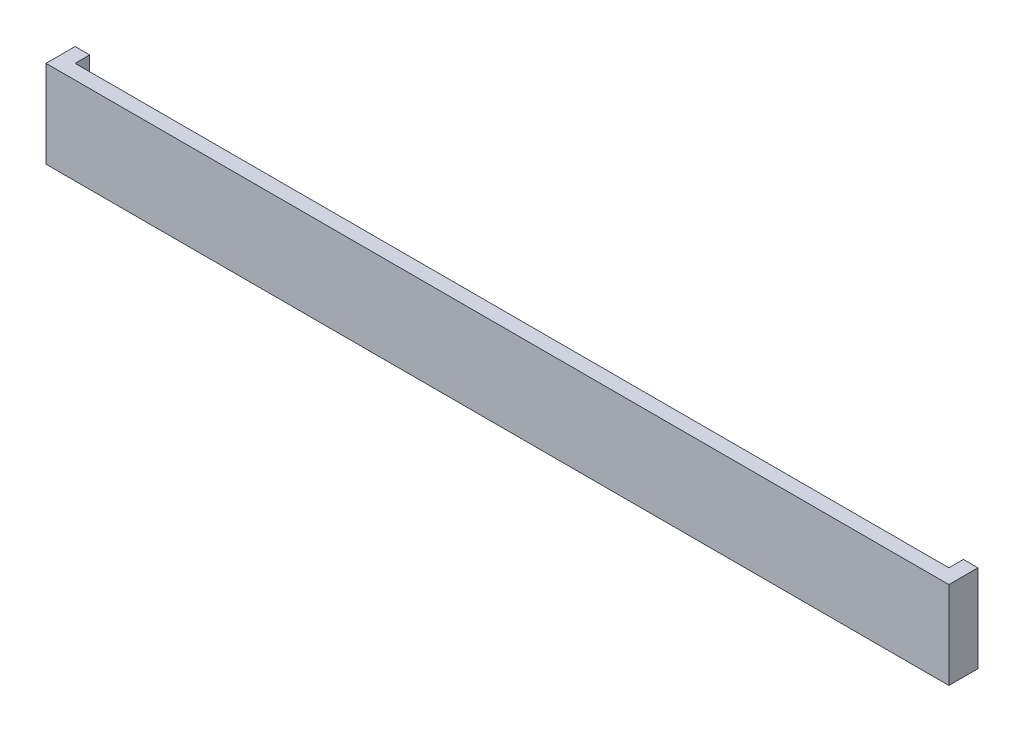
ISO-10303-21;
HEADER;
FILE_DESCRIPTION(('STEP AP214'),'2;1');
FILE_NAME('part.step','',(''),(''),'','','');
FILE_SCHEMA(('AUTOMOTIVE_DESIGN { 1 0 10303 214 1 1 1 1 }'));
ENDSEC;
DATA;
#1=APPLICATION_CONTEXT('core data for automotive mechanical design processes');
#2=APPLICATION_PROTOCOL_DEFINITION('international standard','automotive_design',2000,#1);
#3=PRODUCT_CONTEXT('',#1,'mechanical');
#4=PRODUCT('Part','Part','',(#3));
#5=PRODUCT_RELATED_PRODUCT_CATEGORY('part','',(#4));
#6=PRODUCT_DEFINITION_FORMATION('','',#4);
#7=PRODUCT_DEFINITION_CONTEXT('part definition',#1,'design');
#8=PRODUCT_DEFINITION('design','',#6,#7);
#9=PRODUCT_DEFINITION_SHAPE('','',#8);
#10=(LENGTH_UNIT() NAMED_UNIT(*) SI_UNIT(.MILLI.,.METRE.));
#11=(NAMED_UNIT(*) PLANE_ANGLE_UNIT() SI_UNIT($,.RADIAN.));
#12=(NAMED_UNIT(*) SI_UNIT($,.STERADIAN.) SOLID_ANGLE_UNIT());
#13=UNCERTAINTY_MEASURE_WITH_UNIT(LENGTH_MEASURE(1.E-05),#10,'distance_accuracy_value','');
#14=(GEOMETRIC_REPRESENTATION_CONTEXT(3) GLOBAL_UNCERTAINTY_ASSIGNED_CONTEXT((#13)) GLOBAL_UNIT_ASSIGNED_CONTEXT((#10,
#11,#12)) REPRESENTATION_CONTEXT('',''));
#15=CARTESIAN_POINT('',(0.,0.,0.));
#16=DIRECTION('',(0.,0.,1.));
#17=DIRECTION('',(1.,0.,0.));
#18=AXIS2_PLACEMENT_3D('',#15,#16,#17);
#19=CARTESIAN_POINT('',(0.,0.,0.));
#20=DIRECTION('',(0.,0.,-1.));
#21=DIRECTION('',(-1.,0.,0.));
#22=AXIS2_PLACEMENT_3D('',#19,#20,#21);
#23=PLANE('',#22);
#24=DIRECTION('',(0.,1.,0.));
#25=VECTOR('',#24,1.);
#26=CARTESIAN_POINT('',(-300.,0.,0.));
#27=LINE('',#26,#25);
#28=CARTESIAN_POINT('',(-300.,-30.,0.));
#29=VERTEX_POINT('',#28);
#30=CARTESIAN_POINT('',(-300.,30.,0.));
#31=VERTEX_POINT('',#30);
#32=EDGE_CURVE('E43',#29,#31,#27,.T.);
#33=ORIENTED_EDGE('',*,*,#32,.F.);
#34=DIRECTION('',(1.,0.,0.));
#35=VECTOR('',#34,1.);
#36=CARTESIAN_POINT('',(-310.,-30.,0.));
#37=LINE('',#36,#35);
#38=CARTESIAN_POINT('',(-310.,-30.,0.));
#39=VERTEX_POINT('',#38);
#40=EDGE_CURVE('E139',#39,#29,#37,.T.);
#41=ORIENTED_EDGE('',*,*,#40,.F.);
#42=DIRECTION('',(0.,-1.,0.));
#43=VECTOR('',#42,1.);
#44=CARTESIAN_POINT('',(-310.,-30.,0.));
#45=LINE('',#44,#43);
#46=CARTESIAN_POINT('',(-310.,30.,0.));
#47=VERTEX_POINT('',#46);
#48=EDGE_CURVE('E150',#47,#39,#45,.T.);
#49=ORIENTED_EDGE('',*,*,#48,.F.);
#50=DIRECTION('',(-1.,0.,0.));
#51=VECTOR('',#50,1.);
#52=CARTESIAN_POINT('',(-310.,30.,0.));
#53=LINE('',#52,#51);
#54=EDGE_CURVE('E147',#31,#47,#53,.T.);
#55=ORIENTED_EDGE('',*,*,#54,.F.);
#56=EDGE_LOOP('',(#33,#41,#49,#55));
#57=FACE_BOUND('',#56,.T.);
#58=ADVANCED_FACE('F35',(#57),#23,.T.);
#59=CARTESIAN_POINT('',(310.,-30.,20.));
#60=DIRECTION('',(-1.,0.,0.));
#61=DIRECTION('',(0.,0.,1.));
#62=AXIS2_PLACEMENT_3D('',#59,#60,#61);
#63=PLANE('',#62);
#64=DIRECTION('',(0.,1.,0.));
#65=VECTOR('',#64,1.);
#66=CARTESIAN_POINT('',(310.,-30.,0.));
#67=LINE('',#66,#65);
#68=CARTESIAN_POINT('',(310.,-30.,0.));
#69=VERTEX_POINT('',#68);
#70=CARTESIAN_POINT('',(310.,30.,0.));
#71=VERTEX_POINT('',#70);
#72=EDGE_CURVE('E136',#69,#71,#67,.T.);
#73=ORIENTED_EDGE('',*,*,#72,.T.);
#74=DIRECTION('',(0.,0.,-1.));
#75=VECTOR('',#74,1.);
#76=CARTESIAN_POINT('',(310.,30.,20.));
#77=LINE('',#76,#75);
#78=CARTESIAN_POINT('',(310.,30.,20.));
#79=VERTEX_POINT('',#78);
#80=EDGE_CURVE('E161',#79,#71,#77,.T.);
#81=ORIENTED_EDGE('',*,*,#80,.F.);
#82=DIRECTION('',(0.,1.,0.));
#83=VECTOR('',#82,1.);
#84=CARTESIAN_POINT('',(310.,-30.,20.));
#85=LINE('',#84,#83);
#86=CARTESIAN_POINT('',(310.,-30.,20.));
#87=VERTEX_POINT('',#86);
#88=EDGE_CURVE('E137',#87,#79,#85,.T.);
#89=ORIENTED_EDGE('',*,*,#88,.F.);
#90=DIRECTION('',(0.,0.,-1.));
#91=VECTOR('',#90,1.);
#92=CARTESIAN_POINT('',(310.,-30.,20.));
#93=LINE('',#92,#91);
#94=EDGE_CURVE('E144',#87,#69,#93,.T.);
#95=ORIENTED_EDGE('',*,*,#94,.T.);
#96=EDGE_LOOP('',(#73,#81,#89,#95));
#97=FACE_BOUND('',#96,.T.);
#98=ADVANCED_FACE('F37',(#97),#63,.F.);
#99=CARTESIAN_POINT('',(-310.,30.,20.));
#100=DIRECTION('',(0.,-1.,0.));
#101=DIRECTION('',(0.,0.,-1.));
#102=AXIS2_PLACEMENT_3D('',#99,#100,#101);
#103=PLANE('',#102);
#104=DIRECTION('',(1.,0.,0.));
#105=VECTOR('',#104,1.);
#106=CARTESIAN_POINT('',(-300.,30.,10.));
#107=LINE('',#106,#105);
#108=CARTESIAN_POINT('',(-300.,30.,10.));
#109=VERTEX_POINT('',#108);
#110=CARTESIAN_POINT('',(300.,30.,10.));
#111=VERTEX_POINT('',#110);
#112=EDGE_CURVE('E115',#109,#111,#107,.T.);
#113=ORIENTED_EDGE('',*,*,#112,.F.);
#114=DIRECTION('',(0.,0.,1.));
#115=VECTOR('',#114,1.);
#116=CARTESIAN_POINT('',(-300.,30.,0.));
#117=LINE('',#116,#115);
#118=EDGE_CURVE('E121',#31,#109,#117,.T.);
#119=ORIENTED_EDGE('',*,*,#118,.F.);
#120=ORIENTED_EDGE('',*,*,#54,.T.);
#121=DIRECTION('',(0.,0.,-1.));
#122=VECTOR('',#121,1.);
#123=CARTESIAN_POINT('',(-310.,30.,20.));
#124=LINE('',#123,#122);
#125=CARTESIAN_POINT('',(-310.,30.,20.));
#126=VERTEX_POINT('',#125);
#127=EDGE_CURVE('E158',#126,#47,#124,.T.);
#128=ORIENTED_EDGE('',*,*,#127,.F.);
#129=DIRECTION('',(-1.,0.,0.));
#130=VECTOR('',#129,1.);
#131=CARTESIAN_POINT('',(-310.,30.,20.));
#132=LINE('',#131,#130);
#133=EDGE_CURVE('E88',#79,#126,#132,.T.);
#134=ORIENTED_EDGE('',*,*,#133,.F.);
#135=ORIENTED_EDGE('',*,*,#80,.T.);
#136=CARTESIAN_POINT('',(300.,30.,0.));
#137=VERTEX_POINT('',#136);
#138=EDGE_CURVE('E148',#71,#137,#53,.T.);
#139=ORIENTED_EDGE('',*,*,#138,.T.);
#140=DIRECTION('',(0.,0.,-1.));
#141=VECTOR('',#140,1.);
#142=CARTESIAN_POINT('',(300.,30.,0.));
#143=LINE('',#142,#141);
#144=EDGE_CURVE('E50',#111,#137,#143,.T.);
#145=ORIENTED_EDGE('',*,*,#144,.F.);
#146=EDGE_LOOP('',(#113,#119,#120,#128,#134,#135,#139,#145));
#147=FACE_BOUND('',#146,.T.);
#148=ADVANCED_FACE('F126',(#147),#103,.F.);
#149=CARTESIAN_POINT('',(-310.,-30.,20.));
#150=DIRECTION('',(1.,0.,0.));
#151=DIRECTION('',(0.,0.,-1.));
#152=AXIS2_PLACEMENT_3D('',#149,#150,#151);
#153=PLANE('',#152);
#154=ORIENTED_EDGE('',*,*,#48,.T.);
#155=DIRECTION('',(0.,0.,-1.));
#156=VECTOR('',#155,1.);
#157=CARTESIAN_POINT('',(-310.,-30.,20.));
#158=LINE('',#157,#156);
#159=CARTESIAN_POINT('',(-310.,-30.,20.));
#160=VERTEX_POINT('',#159);
#161=EDGE_CURVE('E155',#160,#39,#158,.T.);
#162=ORIENTED_EDGE('',*,*,#161,.F.);
#163=DIRECTION('',(0.,-1.,0.));
#164=VECTOR('',#163,1.);
#165=CARTESIAN_POINT('',(-310.,-30.,20.));
#166=LINE('',#165,#164);
#167=EDGE_CURVE('E141',#126,#160,#166,.T.);
#168=ORIENTED_EDGE('',*,*,#167,.F.);
#169=ORIENTED_EDGE('',*,*,#127,.T.);
#170=EDGE_LOOP('',(#154,#162,#168,#169));
#171=FACE_BOUND('',#170,.T.);
#172=ADVANCED_FACE('F178',(#171),#153,.F.);
#173=CARTESIAN_POINT('',(-310.,-30.,20.));
#174=DIRECTION('',(0.,1.,0.));
#175=DIRECTION('',(0.,0.,1.));
#176=AXIS2_PLACEMENT_3D('',#173,#174,#175);
#177=PLANE('',#176);
#178=ORIENTED_EDGE('',*,*,#40,.T.);
#179=DIRECTION('',(0.,0.,1.));
#180=VECTOR('',#179,1.);
#181=CARTESIAN_POINT('',(-300.,-30.,20.));
#182=LINE('',#181,#180);
#183=CARTESIAN_POINT('',(-300.,-30.,10.));
#184=VERTEX_POINT('',#183);
#185=EDGE_CURVE('E134',#29,#184,#182,.T.);
#186=ORIENTED_EDGE('',*,*,#185,.T.);
#187=DIRECTION('',(1.,0.,0.));
#188=VECTOR('',#187,1.);
#189=CARTESIAN_POINT('',(-310.,-30.,10.));
#190=LINE('',#189,#188);
#191=CARTESIAN_POINT('',(300.,-30.,10.));
#192=VERTEX_POINT('',#191);
#193=EDGE_CURVE('E11',#184,#192,#190,.T.);
#194=ORIENTED_EDGE('',*,*,#193,.T.);
#195=DIRECTION('',(0.,0.,-1.));
#196=VECTOR('',#195,1.);
#197=CARTESIAN_POINT('',(300.,-30.,20.));
#198=LINE('',#197,#196);
#199=CARTESIAN_POINT('',(300.,-30.,0.));
#200=VERTEX_POINT('',#199);
#201=EDGE_CURVE('E131',#192,#200,#198,.T.);
#202=ORIENTED_EDGE('',*,*,#201,.T.);
#203=EDGE_CURVE('E80',#200,#69,#37,.T.);
#204=ORIENTED_EDGE('',*,*,#203,.T.);
#205=ORIENTED_EDGE('',*,*,#94,.F.);
#206=DIRECTION('',(1.,0.,0.));
#207=VECTOR('',#206,1.);
#208=CARTESIAN_POINT('',(-310.,-30.,20.));
#209=LINE('',#208,#207);
#210=EDGE_CURVE('E59',#160,#87,#209,.T.);
#211=ORIENTED_EDGE('',*,*,#210,.F.);
#212=ORIENTED_EDGE('',*,*,#161,.T.);
#213=EDGE_LOOP('',(#178,#186,#194,#202,#204,#205,#211,#212));
#214=FACE_BOUND('',#213,.T.);
#215=ADVANCED_FACE('F166',(#214),#177,.F.);
#216=CARTESIAN_POINT('',(0.,0.,20.));
#217=DIRECTION('',(0.,0.,-1.));
#218=DIRECTION('',(-1.,0.,0.));
#219=AXIS2_PLACEMENT_3D('',#216,#217,#218);
#220=PLANE('',#219);
#221=ORIENTED_EDGE('',*,*,#88,.T.);
#222=ORIENTED_EDGE('',*,*,#133,.T.);
#223=ORIENTED_EDGE('',*,*,#167,.T.);
#224=ORIENTED_EDGE('',*,*,#210,.T.);
#225=EDGE_LOOP('',(#221,#222,#223,#224));
#226=FACE_BOUND('',#225,.T.);
#227=ADVANCED_FACE('F179',(#226),#220,.F.);
#228=DIRECTION('',(0.,-1.,0.));
#229=VECTOR('',#228,1.);
#230=CARTESIAN_POINT('',(300.,0.,0.));
#231=LINE('',#230,#229);
#232=EDGE_CURVE('E163',#137,#200,#231,.T.);
#233=ORIENTED_EDGE('',*,*,#232,.F.);
#234=ORIENTED_EDGE('',*,*,#138,.F.);
#235=ORIENTED_EDGE('',*,*,#72,.F.);
#236=ORIENTED_EDGE('',*,*,#203,.F.);
#237=EDGE_LOOP('',(#233,#234,#235,#236));
#238=FACE_BOUND('',#237,.T.);
#239=ADVANCED_FACE('F168',(#238),#23,.T.);
#240=CARTESIAN_POINT('',(-300.,-70.,10.));
#241=DIRECTION('',(0.,0.,1.));
#242=DIRECTION('',(1.,0.,0.));
#243=AXIS2_PLACEMENT_3D('',#240,#241,#242);
#244=PLANE('',#243);
#245=DIRECTION('',(0.,1.,0.));
#246=VECTOR('',#245,1.);
#247=CARTESIAN_POINT('',(-300.,-70.,10.));
#248=LINE('',#247,#246);
#249=EDGE_CURVE('E110',#184,#109,#248,.T.);
#250=ORIENTED_EDGE('',*,*,#249,.T.);
#251=ORIENTED_EDGE('',*,*,#112,.T.);
#252=DIRECTION('',(0.,1.,0.));
#253=VECTOR('',#252,1.);
#254=CARTESIAN_POINT('',(300.,-70.,10.));
#255=LINE('',#254,#253);
#256=EDGE_CURVE('E118',#192,#111,#255,.T.);
#257=ORIENTED_EDGE('',*,*,#256,.F.);
#258=ORIENTED_EDGE('',*,*,#193,.F.);
#259=EDGE_LOOP('',(#250,#251,#257,#258));
#260=FACE_BOUND('',#259,.T.);
#261=ADVANCED_FACE('F112',(#260),#244,.F.);
#262=CARTESIAN_POINT('',(-300.,-70.,0.));
#263=DIRECTION('',(-1.,0.,0.));
#264=DIRECTION('',(0.,0.,1.));
#265=AXIS2_PLACEMENT_3D('',#262,#263,#264);
#266=PLANE('',#265);
#267=ORIENTED_EDGE('',*,*,#32,.T.);
#268=ORIENTED_EDGE('',*,*,#118,.T.);
#269=ORIENTED_EDGE('',*,*,#249,.F.);
#270=ORIENTED_EDGE('',*,*,#185,.F.);
#271=EDGE_LOOP('',(#267,#268,#269,#270));
#272=FACE_BOUND('',#271,.T.);
#273=ADVANCED_FACE('F122',(#272),#266,.F.);
#274=CARTESIAN_POINT('',(300.,-70.,0.));
#275=DIRECTION('',(1.,0.,0.));
#276=DIRECTION('',(0.,0.,-1.));
#277=AXIS2_PLACEMENT_3D('',#274,#275,#276);
#278=PLANE('',#277);
#279=ORIENTED_EDGE('',*,*,#256,.T.);
#280=ORIENTED_EDGE('',*,*,#144,.T.);
#281=ORIENTED_EDGE('',*,*,#232,.T.);
#282=ORIENTED_EDGE('',*,*,#201,.F.);
#283=EDGE_LOOP('',(#279,#280,#281,#282));
#284=FACE_BOUND('',#283,.T.);
#285=ADVANCED_FACE('F164',(#284),#278,.F.);
#286=CLOSED_SHELL('',(#58,#98,#148,#172,#215,#227,#239,#261,#273,#285));
#287=MANIFOLD_SOLID_BREP('B2',#286);
#288=ADVANCED_BREP_SHAPE_REPRESENTATION('',(#18,#287),#14);
#289=SHAPE_DEFINITION_REPRESENTATION(#9,#288);
ENDSEC;
END-ISO-10303-21;
